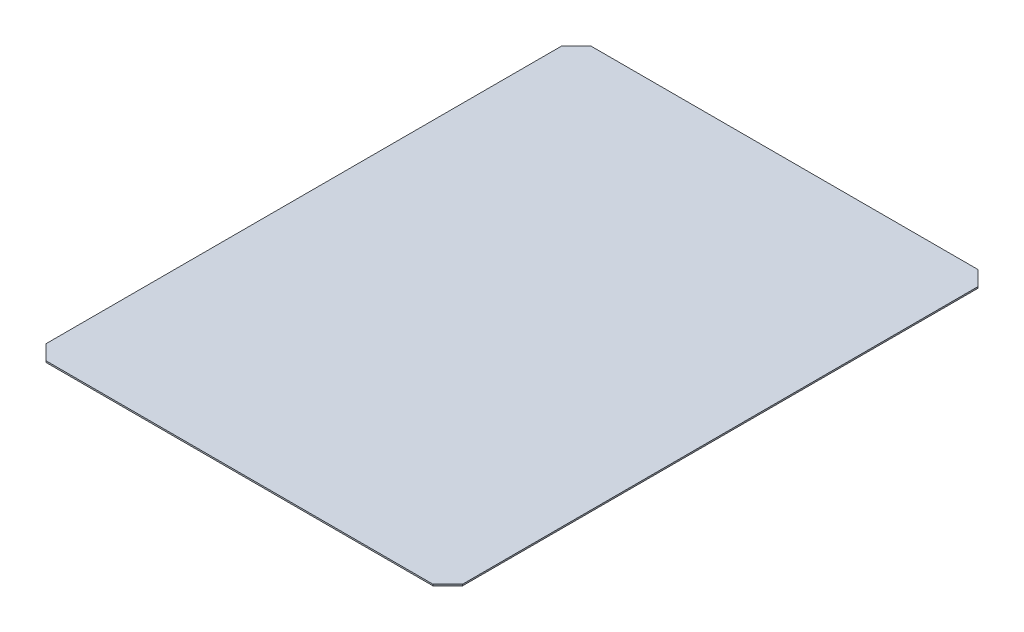
ISO-10303-21;
HEADER;
FILE_DESCRIPTION(('STEP AP214'),'2;1');
FILE_NAME('part.step','',(''),(''),'','','');
FILE_SCHEMA(('AUTOMOTIVE_DESIGN { 1 0 10303 214 1 1 1 1 }'));
ENDSEC;
DATA;
#1=APPLICATION_CONTEXT('core data for automotive mechanical design processes');
#2=APPLICATION_PROTOCOL_DEFINITION('international standard','automotive_design',2000,#1);
#3=PRODUCT_CONTEXT('',#1,'mechanical');
#4=PRODUCT('Part','Part','',(#3));
#5=PRODUCT_RELATED_PRODUCT_CATEGORY('part','',(#4));
#6=PRODUCT_DEFINITION_FORMATION('','',#4);
#7=PRODUCT_DEFINITION_CONTEXT('part definition',#1,'design');
#8=PRODUCT_DEFINITION('design','',#6,#7);
#9=PRODUCT_DEFINITION_SHAPE('','',#8);
#10=(LENGTH_UNIT() NAMED_UNIT(*) SI_UNIT(.MILLI.,.METRE.));
#11=(NAMED_UNIT(*) PLANE_ANGLE_UNIT() SI_UNIT($,.RADIAN.));
#12=(NAMED_UNIT(*) SI_UNIT($,.STERADIAN.) SOLID_ANGLE_UNIT());
#13=UNCERTAINTY_MEASURE_WITH_UNIT(LENGTH_MEASURE(1.E-05),#10,'distance_accuracy_value','');
#14=(GEOMETRIC_REPRESENTATION_CONTEXT(3) GLOBAL_UNCERTAINTY_ASSIGNED_CONTEXT((#13)) GLOBAL_UNIT_ASSIGNED_CONTEXT((#10,
#11,#12)) REPRESENTATION_CONTEXT('',''));
#15=CARTESIAN_POINT('',(0.,0.,0.));
#16=DIRECTION('',(0.,0.,1.));
#17=DIRECTION('',(1.,0.,0.));
#18=AXIS2_PLACEMENT_3D('',#15,#16,#17);
#19=CARTESIAN_POINT('',(0.,10.,0.));
#20=DIRECTION('',(0.,0.,-1.));
#21=DIRECTION('',(-1.,0.,0.));
#22=AXIS2_PLACEMENT_3D('',#19,#20,#21);
#23=PLANE('',#22);
#24=DIRECTION('',(1.,0.,0.));
#25=VECTOR('',#24,1.);
#26=CARTESIAN_POINT('',(0.,0.,0.));
#27=LINE('',#26,#25);
#28=CARTESIAN_POINT('',(240.000000000001,0.,0.));
#29=VERTEX_POINT('',#28);
#30=CARTESIAN_POINT('',(2860.,0.,0.));
#31=VERTEX_POINT('',#30);
#32=EDGE_CURVE('E151',#29,#31,#27,.T.);
#33=ORIENTED_EDGE('',*,*,#32,.T.);
#34=DIRECTION('',(0.,1.,0.));
#35=VECTOR('',#34,1.);
#36=CARTESIAN_POINT('',(2860.,10.,0.));
#37=LINE('',#36,#35);
#38=CARTESIAN_POINT('',(2860.,10.,0.));
#39=VERTEX_POINT('',#38);
#40=EDGE_CURVE('E125',#31,#39,#37,.T.);
#41=ORIENTED_EDGE('',*,*,#40,.T.);
#42=DIRECTION('',(1.,0.,0.));
#43=VECTOR('',#42,1.);
#44=CARTESIAN_POINT('',(0.,10.,0.));
#45=LINE('',#44,#43);
#46=CARTESIAN_POINT('',(240.000000000001,10.,0.));
#47=VERTEX_POINT('',#46);
#48=EDGE_CURVE('E150',#47,#39,#45,.T.);
#49=ORIENTED_EDGE('',*,*,#48,.F.);
#50=DIRECTION('',(0.,-1.,0.));
#51=VECTOR('',#50,1.);
#52=CARTESIAN_POINT('',(240.000000000001,10.,0.));
#53=LINE('',#52,#51);
#54=EDGE_CURVE('E128',#47,#29,#53,.T.);
#55=ORIENTED_EDGE('',*,*,#54,.T.);
#56=EDGE_LOOP('',(#33,#41,#49,#55));
#57=FACE_BOUND('',#56,.T.);
#58=ADVANCED_FACE('F35',(#57),#23,.F.);
#59=CARTESIAN_POINT('',(0.,10.,-3690.));
#60=DIRECTION('',(0.,0.,1.));
#61=DIRECTION('',(1.,0.,0.));
#62=AXIS2_PLACEMENT_3D('',#59,#60,#61);
#63=PLANE('',#62);
#64=DIRECTION('',(-1.,0.,0.));
#65=VECTOR('',#64,1.);
#66=CARTESIAN_POINT('',(0.,0.,-3690.));
#67=LINE('',#66,#65);
#68=CARTESIAN_POINT('',(2860.,0.,-3690.));
#69=VERTEX_POINT('',#68);
#70=CARTESIAN_POINT('',(240.,0.,-3690.));
#71=VERTEX_POINT('',#70);
#72=EDGE_CURVE('E141',#69,#71,#67,.T.);
#73=ORIENTED_EDGE('',*,*,#72,.T.);
#74=DIRECTION('',(0.,1.,0.));
#75=VECTOR('',#74,1.);
#76=CARTESIAN_POINT('',(240.,10.,-3690.));
#77=LINE('',#76,#75);
#78=CARTESIAN_POINT('',(240.,10.,-3690.));
#79=VERTEX_POINT('',#78);
#80=EDGE_CURVE('E11',#71,#79,#77,.T.);
#81=ORIENTED_EDGE('',*,*,#80,.T.);
#82=DIRECTION('',(-1.,0.,0.));
#83=VECTOR('',#82,1.);
#84=CARTESIAN_POINT('',(0.,10.,-3690.));
#85=LINE('',#84,#83);
#86=CARTESIAN_POINT('',(2860.,10.,-3690.));
#87=VERTEX_POINT('',#86);
#88=EDGE_CURVE('E143',#87,#79,#85,.T.);
#89=ORIENTED_EDGE('',*,*,#88,.F.);
#90=DIRECTION('',(0.,-1.,0.));
#91=VECTOR('',#90,1.);
#92=CARTESIAN_POINT('',(2860.,10.,-3690.));
#93=LINE('',#92,#91);
#94=EDGE_CURVE('E43',#87,#69,#93,.T.);
#95=ORIENTED_EDGE('',*,*,#94,.T.);
#96=EDGE_LOOP('',(#73,#81,#89,#95));
#97=FACE_BOUND('',#96,.T.);
#98=ADVANCED_FACE('F140',(#97),#63,.F.);
#99=CARTESIAN_POINT('',(0.,10.,0.));
#100=DIRECTION('',(0.,-1.,0.));
#101=DIRECTION('',(0.,0.,-1.));
#102=AXIS2_PLACEMENT_3D('',#99,#100,#101);
#103=PLANE('',#102);
#104=ORIENTED_EDGE('',*,*,#48,.T.);
#105=DIRECTION('',(-0.707106781186549,0.,0.707106781186546));
#106=VECTOR('',#105,1.);
#107=CARTESIAN_POINT('',(2960.,10.,-100.000000000001));
#108=LINE('',#107,#106);
#109=CARTESIAN_POINT('',(2960.,9.99999999999998,-100.000000000002));
#110=VERTEX_POINT('',#109);
#111=EDGE_CURVE('E120',#39,#110,#108,.F.);
#112=ORIENTED_EDGE('',*,*,#111,.T.);
#113=DIRECTION('',(0.,0.,1.));
#114=VECTOR('',#113,1.);
#115=CARTESIAN_POINT('',(2960.,9.99999999999998,-3980.6));
#116=LINE('',#115,#114);
#117=CARTESIAN_POINT('',(2960.,9.99999999999998,-3590.));
#118=VERTEX_POINT('',#117);
#119=EDGE_CURVE('E107',#118,#110,#116,.T.);
#120=ORIENTED_EDGE('',*,*,#119,.F.);
#121=DIRECTION('',(0.707106781186544,0.,0.707106781186551));
#122=VECTOR('',#121,1.);
#123=CARTESIAN_POINT('',(2860.,10.,-3690.));
#124=LINE('',#123,#122);
#125=EDGE_CURVE('E117',#118,#87,#124,.F.);
#126=ORIENTED_EDGE('',*,*,#125,.T.);
#127=ORIENTED_EDGE('',*,*,#88,.T.);
#128=DIRECTION('',(0.707106781186544,0.,-0.707106781186551));
#129=VECTOR('',#128,1.);
#130=CARTESIAN_POINT('',(240.,10.,-3690.));
#131=LINE('',#130,#129);
#132=CARTESIAN_POINT('',(140.,10.,-3590.));
#133=VERTEX_POINT('',#132);
#134=EDGE_CURVE('E58',#79,#133,#131,.F.);
#135=ORIENTED_EDGE('',*,*,#134,.T.);
#136=DIRECTION('',(0.,0.,1.));
#137=VECTOR('',#136,1.);
#138=CARTESIAN_POINT('',(140.,10.,-3980.6));
#139=LINE('',#138,#137);
#140=CARTESIAN_POINT('',(140.,10.,-100.000000000002));
#141=VERTEX_POINT('',#140);
#142=EDGE_CURVE('E121',#133,#141,#139,.T.);
#143=ORIENTED_EDGE('',*,*,#142,.T.);
#144=DIRECTION('',(-0.707106781186549,0.,-0.707106781186546));
#145=VECTOR('',#144,1.);
#146=CARTESIAN_POINT('',(140.,10.,-100.000000000001));
#147=LINE('',#146,#145);
#148=EDGE_CURVE('E50',#141,#47,#147,.F.);
#149=ORIENTED_EDGE('',*,*,#148,.T.);
#150=EDGE_LOOP('',(#104,#112,#120,#126,#127,#135,#143,#149));
#151=FACE_BOUND('',#150,.T.);
#152=ADVANCED_FACE('F116',(#151),#103,.F.);
#153=CARTESIAN_POINT('',(0.,0.,0.));
#154=DIRECTION('',(0.,-1.,0.));
#155=DIRECTION('',(0.,0.,-1.));
#156=AXIS2_PLACEMENT_3D('',#153,#154,#155);
#157=PLANE('',#156);
#158=DIRECTION('',(0.,0.,-1.));
#159=VECTOR('',#158,1.);
#160=CARTESIAN_POINT('',(2960.,0.,0.));
#161=LINE('',#160,#159);
#162=CARTESIAN_POINT('',(2960.,0.,-100.000000000001));
#163=VERTEX_POINT('',#162);
#164=CARTESIAN_POINT('',(2960.,0.,-3590.));
#165=VERTEX_POINT('',#164);
#166=EDGE_CURVE('E110',#163,#165,#161,.T.);
#167=ORIENTED_EDGE('',*,*,#166,.F.);
#168=DIRECTION('',(0.707106781186549,0.,-0.707106781186546));
#169=VECTOR('',#168,1.);
#170=CARTESIAN_POINT('',(1429.99999999999,0.,1430.));
#171=LINE('',#170,#169);
#172=EDGE_CURVE('E167',#163,#31,#171,.F.);
#173=ORIENTED_EDGE('',*,*,#172,.T.);
#174=ORIENTED_EDGE('',*,*,#32,.F.);
#175=DIRECTION('',(0.707106781186549,0.,0.707106781186546));
#176=VECTOR('',#175,1.);
#177=CARTESIAN_POINT('',(120.,0.,-120.000000000001));
#178=LINE('',#177,#176);
#179=CARTESIAN_POINT('',(140.,0.,-100.000000000001));
#180=VERTEX_POINT('',#179);
#181=EDGE_CURVE('E165',#29,#180,#178,.F.);
#182=ORIENTED_EDGE('',*,*,#181,.T.);
#183=DIRECTION('',(0.,0.,1.));
#184=VECTOR('',#183,1.);
#185=CARTESIAN_POINT('',(140.,0.,0.));
#186=LINE('',#185,#184);
#187=CARTESIAN_POINT('',(140.,0.,-3590.));
#188=VERTEX_POINT('',#187);
#189=EDGE_CURVE('E158',#188,#180,#186,.T.);
#190=ORIENTED_EDGE('',*,*,#189,.F.);
#191=DIRECTION('',(-0.707106781186544,0.,0.707106781186551));
#192=VECTOR('',#191,1.);
#193=CARTESIAN_POINT('',(-1725.,0.,-1724.99999999998));
#194=LINE('',#193,#192);
#195=EDGE_CURVE('E149',#188,#71,#194,.F.);
#196=ORIENTED_EDGE('',*,*,#195,.T.);
#197=ORIENTED_EDGE('',*,*,#72,.F.);
#198=DIRECTION('',(-0.707106781186544,0.,-0.707106781186551));
#199=VECTOR('',#198,1.);
#200=CARTESIAN_POINT('',(3275.00000000001,0.,-3274.99999999998));
#201=LINE('',#200,#199);
#202=EDGE_CURVE('E146',#69,#165,#201,.F.);
#203=ORIENTED_EDGE('',*,*,#202,.T.);
#204=EDGE_LOOP('',(#167,#173,#174,#182,#190,#196,#197,#203));
#205=FACE_BOUND('',#204,.T.);
#206=ADVANCED_FACE('F145',(#205),#157,.T.);
#207=CARTESIAN_POINT('',(140.,10.,-3980.6));
#208=DIRECTION('',(1.,0.,0.));
#209=DIRECTION('',(0.,0.,-1.));
#210=AXIS2_PLACEMENT_3D('',#207,#208,#209);
#211=PLANE('',#210);
#212=ORIENTED_EDGE('',*,*,#189,.T.);
#213=DIRECTION('',(0.,1.,0.));
#214=VECTOR('',#213,1.);
#215=CARTESIAN_POINT('',(140.,10.,-100.000000000001));
#216=LINE('',#215,#214);
#217=EDGE_CURVE('E136',#180,#141,#216,.T.);
#218=ORIENTED_EDGE('',*,*,#217,.T.);
#219=ORIENTED_EDGE('',*,*,#142,.F.);
#220=DIRECTION('',(0.,-1.,0.));
#221=VECTOR('',#220,1.);
#222=CARTESIAN_POINT('',(140.,10.,-3590.));
#223=LINE('',#222,#221);
#224=EDGE_CURVE('E134',#133,#188,#223,.T.);
#225=ORIENTED_EDGE('',*,*,#224,.T.);
#226=EDGE_LOOP('',(#212,#218,#219,#225));
#227=FACE_BOUND('',#226,.T.);
#228=ADVANCED_FACE('F175',(#227),#211,.F.);
#229=CARTESIAN_POINT('',(2960.,9.99999999999998,-3980.6));
#230=DIRECTION('',(-1.,0.,0.));
#231=DIRECTION('',(0.,0.,1.));
#232=AXIS2_PLACEMENT_3D('',#229,#230,#231);
#233=PLANE('',#232);
#234=ORIENTED_EDGE('',*,*,#119,.T.);
#235=DIRECTION('',(0.,-1.,0.));
#236=VECTOR('',#235,1.);
#237=CARTESIAN_POINT('',(2960.,9.99999999999998,-100.000000000001));
#238=LINE('',#237,#236);
#239=EDGE_CURVE('E113',#110,#163,#238,.T.);
#240=ORIENTED_EDGE('',*,*,#239,.T.);
#241=ORIENTED_EDGE('',*,*,#166,.T.);
#242=DIRECTION('',(0.,1.,0.));
#243=VECTOR('',#242,1.);
#244=CARTESIAN_POINT('',(2960.,9.99999999999998,-3590.));
#245=LINE('',#244,#243);
#246=EDGE_CURVE('E103',#165,#118,#245,.T.);
#247=ORIENTED_EDGE('',*,*,#246,.T.);
#248=EDGE_LOOP('',(#234,#240,#241,#247));
#249=FACE_BOUND('',#248,.T.);
#250=ADVANCED_FACE('F105',(#249),#233,.F.);
#251=CARTESIAN_POINT('',(2960.,9.99999999999998,-100.000000000001));
#252=DIRECTION('',(-0.707106781186546,0.,-0.707106781186549));
#253=DIRECTION('',(0.,-1.,0.));
#254=AXIS2_PLACEMENT_3D('',#251,#252,#253);
#255=PLANE('',#254);
#256=ORIENTED_EDGE('',*,*,#111,.F.);
#257=ORIENTED_EDGE('',*,*,#40,.F.);
#258=ORIENTED_EDGE('',*,*,#172,.F.);
#259=ORIENTED_EDGE('',*,*,#239,.F.);
#260=EDGE_LOOP('',(#256,#257,#258,#259));
#261=FACE_BOUND('',#260,.T.);
#262=ADVANCED_FACE('F179',(#261),#255,.F.);
#263=CARTESIAN_POINT('',(140.,10.,-100.000000000001));
#264=DIRECTION('',(0.707106781186546,0.,-0.707106781186549));
#265=DIRECTION('',(0.,1.,0.));
#266=AXIS2_PLACEMENT_3D('',#263,#264,#265);
#267=PLANE('',#266);
#268=ORIENTED_EDGE('',*,*,#181,.F.);
#269=ORIENTED_EDGE('',*,*,#54,.F.);
#270=ORIENTED_EDGE('',*,*,#148,.F.);
#271=ORIENTED_EDGE('',*,*,#217,.F.);
#272=EDGE_LOOP('',(#268,#269,#270,#271));
#273=FACE_BOUND('',#272,.T.);
#274=ADVANCED_FACE('F173',(#273),#267,.F.);
#275=CARTESIAN_POINT('',(240.,10.,-3690.));
#276=DIRECTION('',(0.707106781186551,0.,0.707106781186544));
#277=DIRECTION('',(0.,1.,0.));
#278=AXIS2_PLACEMENT_3D('',#275,#276,#277);
#279=PLANE('',#278);
#280=ORIENTED_EDGE('',*,*,#195,.F.);
#281=ORIENTED_EDGE('',*,*,#224,.F.);
#282=ORIENTED_EDGE('',*,*,#134,.F.);
#283=ORIENTED_EDGE('',*,*,#80,.F.);
#284=EDGE_LOOP('',(#280,#281,#282,#283));
#285=FACE_BOUND('',#284,.T.);
#286=ADVANCED_FACE('F186',(#285),#279,.F.);
#287=CARTESIAN_POINT('',(2860.,10.,-3690.));
#288=DIRECTION('',(-0.707106781186551,0.,0.707106781186544));
#289=DIRECTION('',(0.,-1.,0.));
#290=AXIS2_PLACEMENT_3D('',#287,#288,#289);
#291=PLANE('',#290);
#292=ORIENTED_EDGE('',*,*,#125,.F.);
#293=ORIENTED_EDGE('',*,*,#246,.F.);
#294=ORIENTED_EDGE('',*,*,#202,.F.);
#295=ORIENTED_EDGE('',*,*,#94,.F.);
#296=EDGE_LOOP('',(#292,#293,#294,#295));
#297=FACE_BOUND('',#296,.T.);
#298=ADVANCED_FACE('F37',(#297),#291,.F.);
#299=CLOSED_SHELL('',(#58,#98,#152,#206,#228,#250,#262,#274,#286,#298));
#300=MANIFOLD_SOLID_BREP('B2',#299);
#301=ADVANCED_BREP_SHAPE_REPRESENTATION('',(#18,#300),#14);
#302=SHAPE_DEFINITION_REPRESENTATION(#9,#301);
ENDSEC;
END-ISO-10303-21;
